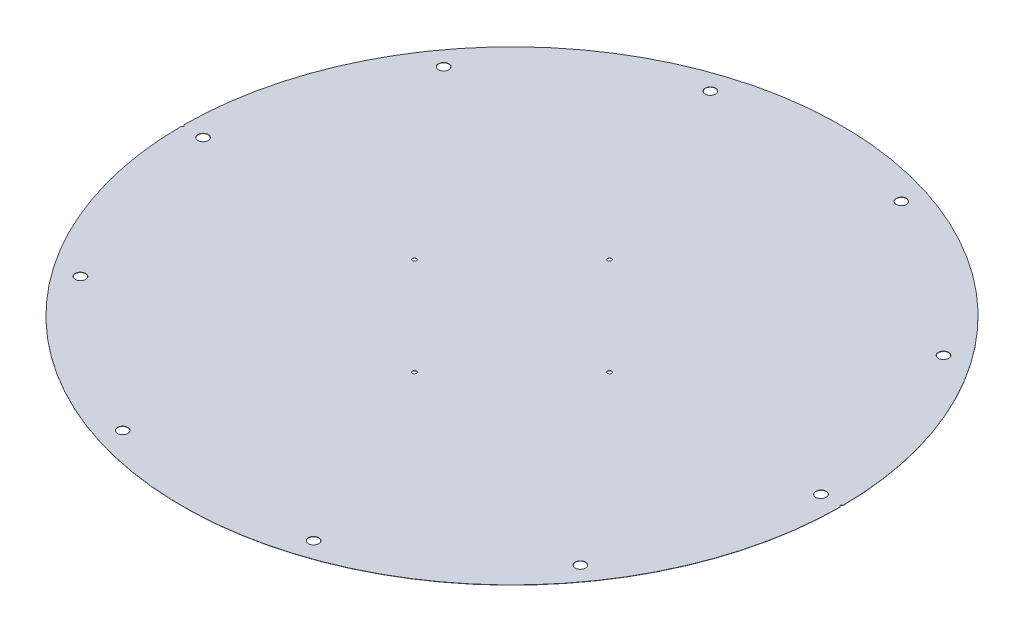
ISO-10303-21;
HEADER;
FILE_DESCRIPTION(('STEP AP214'),'2;1');
FILE_NAME('part.step','',(''),(''),'','','');
FILE_SCHEMA(('AUTOMOTIVE_DESIGN { 1 0 10303 214 1 1 1 1 }'));
ENDSEC;
DATA;
#1=APPLICATION_CONTEXT('core data for automotive mechanical design processes');
#2=APPLICATION_PROTOCOL_DEFINITION('international standard','automotive_design',2000,#1);
#3=PRODUCT_CONTEXT('',#1,'mechanical');
#4=PRODUCT('Part','Part','',(#3));
#5=PRODUCT_RELATED_PRODUCT_CATEGORY('part','',(#4));
#6=PRODUCT_DEFINITION_FORMATION('','',#4);
#7=PRODUCT_DEFINITION_CONTEXT('part definition',#1,'design');
#8=PRODUCT_DEFINITION('design','',#6,#7);
#9=PRODUCT_DEFINITION_SHAPE('','',#8);
#10=(LENGTH_UNIT() NAMED_UNIT(*) SI_UNIT(.MILLI.,.METRE.));
#11=(NAMED_UNIT(*) PLANE_ANGLE_UNIT() SI_UNIT($,.RADIAN.));
#12=(NAMED_UNIT(*) SI_UNIT($,.STERADIAN.) SOLID_ANGLE_UNIT());
#13=UNCERTAINTY_MEASURE_WITH_UNIT(LENGTH_MEASURE(1.E-05),#10,'distance_accuracy_value','');
#14=(GEOMETRIC_REPRESENTATION_CONTEXT(3) GLOBAL_UNCERTAINTY_ASSIGNED_CONTEXT((#13)) GLOBAL_UNIT_ASSIGNED_CONTEXT((#10,
#11,#12)) REPRESENTATION_CONTEXT('',''));
#15=CARTESIAN_POINT('',(0.,0.,0.));
#16=DIRECTION('',(0.,0.,1.));
#17=DIRECTION('',(1.,0.,0.));
#18=AXIS2_PLACEMENT_3D('',#15,#16,#17);
#19=CARTESIAN_POINT('',(0.,6.35,0.));
#20=DIRECTION('',(0.,-1.,0.));
#21=DIRECTION('',(0.,0.,-1.));
#22=AXIS2_PLACEMENT_3D('',#19,#20,#21);
#23=CYLINDRICAL_SURFACE('',#22,406.4);
#24=DIRECTION('',(0.,1.,0.));
#25=VECTOR('',#24,1.);
#26=CARTESIAN_POINT('',(406.396899414062,3.175,-1.58749697208118));
#27=LINE('',#26,#25);
#28=CARTESIAN_POINT('',(406.396899414062,6.35,-1.58749697208118));
#29=VERTEX_POINT('',#28);
#30=CARTESIAN_POINT('',(406.396899414062,6.096,-1.58749697208132));
#31=VERTEX_POINT('',#30);
#32=EDGE_CURVE('E47',#29,#31,#27,.F.);
#33=ORIENTED_EDGE('',*,*,#32,.T.);
#34=CARTESIAN_POINT('',(0.,6.096,0.));
#35=DIRECTION('',(0.,1.,0.));
#36=DIRECTION('',(0.,0.,1.));
#37=AXIS2_PLACEMENT_3D('',#34,#35,#36);
#38=CIRCLE('',#37,406.4);
#39=CARTESIAN_POINT('',(-406.396899414062,6.096,-1.58749697208395));
#40=VERTEX_POINT('',#39);
#41=EDGE_CURVE('E81',#31,#40,#38,.T.);
#42=ORIENTED_EDGE('',*,*,#41,.T.);
#43=DIRECTION('',(0.,1.,0.));
#44=VECTOR('',#43,1.);
#45=CARTESIAN_POINT('',(-406.396899414062,3.175,-1.58749697208118));
#46=LINE('',#45,#44);
#47=CARTESIAN_POINT('',(-406.396899414062,6.35,-1.58749697208118));
#48=VERTEX_POINT('',#47);
#49=EDGE_CURVE('E97',#40,#48,#46,.T.);
#50=ORIENTED_EDGE('',*,*,#49,.T.);
#51=CARTESIAN_POINT('',(0.,6.35,0.));
#52=DIRECTION('',(0.,1.,0.));
#53=DIRECTION('',(0.,0.,1.));
#54=AXIS2_PLACEMENT_3D('',#51,#52,#53);
#55=CIRCLE('',#54,406.4);
#56=EDGE_CURVE('E114',#29,#48,#55,.T.);
#57=ORIENTED_EDGE('',*,*,#56,.F.);
#58=EDGE_LOOP('',(#33,#42,#50,#57));
#59=FACE_BOUND('',#58,.T.);
#60=ADVANCED_FACE('F39',(#59),#23,.T.);
#61=DIRECTION('',(0.,1.,0.));
#62=VECTOR('',#61,1.);
#63=CARTESIAN_POINT('',(-406.396899414062,3.175,1.58749697208118));
#64=LINE('',#63,#62);
#65=CARTESIAN_POINT('',(-406.396899414062,6.35,1.58749697208118));
#66=VERTEX_POINT('',#65);
#67=CARTESIAN_POINT('',(-406.396899414062,6.096,1.58749697208118));
#68=VERTEX_POINT('',#67);
#69=EDGE_CURVE('E86',#66,#68,#64,.F.);
#70=ORIENTED_EDGE('',*,*,#69,.T.);
#71=CARTESIAN_POINT('',(0.,6.096,0.));
#72=DIRECTION('',(0.,1.,0.));
#73=DIRECTION('',(0.,0.,1.));
#74=AXIS2_PLACEMENT_3D('',#71,#72,#73);
#75=CIRCLE('',#74,406.4);
#76=CARTESIAN_POINT('',(406.396899414062,6.096,1.58749697208138));
#77=VERTEX_POINT('',#76);
#78=EDGE_CURVE('E54',#68,#77,#75,.T.);
#79=ORIENTED_EDGE('',*,*,#78,.T.);
#80=DIRECTION('',(0.,1.,0.));
#81=VECTOR('',#80,1.);
#82=CARTESIAN_POINT('',(406.396899414062,3.175,1.58749697208118));
#83=LINE('',#82,#81);
#84=CARTESIAN_POINT('',(406.396899414062,6.35,1.58749697208118));
#85=VERTEX_POINT('',#84);
#86=EDGE_CURVE('E12',#77,#85,#83,.T.);
#87=ORIENTED_EDGE('',*,*,#86,.T.);
#88=EDGE_CURVE('E117',#66,#85,#55,.T.);
#89=ORIENTED_EDGE('',*,*,#88,.F.);
#90=EDGE_LOOP('',(#70,#79,#87,#89));
#91=FACE_BOUND('',#90,.T.);
#92=ADVANCED_FACE('F41',(#91),#23,.T.);
#93=CARTESIAN_POINT('',(0.,6.35,0.));
#94=DIRECTION('',(0.,1.,0.));
#95=DIRECTION('',(0.,0.,1.));
#96=AXIS2_PLACEMENT_3D('',#93,#94,#95);
#97=PLANE('',#96);
#98=CARTESIAN_POINT('',(-406.4,6.35,0.));
#99=DIRECTION('',(0.,1.,0.));
#100=DIRECTION('',(0.,0.,1.));
#101=AXIS2_PLACEMENT_3D('',#98,#99,#100);
#102=CIRCLE('',#101,1.58750000000002);
#103=EDGE_CURVE('E128',#66,#48,#102,.T.);
#104=ORIENTED_EDGE('',*,*,#103,.F.);
#105=ORIENTED_EDGE('',*,*,#88,.T.);
#106=CARTESIAN_POINT('',(406.4,6.35,0.));
#107=DIRECTION('',(0.,1.,0.));
#108=DIRECTION('',(0.,0.,1.));
#109=AXIS2_PLACEMENT_3D('',#106,#107,#108);
#110=CIRCLE('',#109,1.58750000000002);
#111=EDGE_CURVE('E92',#29,#85,#110,.T.);
#112=ORIENTED_EDGE('',*,*,#111,.F.);
#113=ORIENTED_EDGE('',*,*,#56,.T.);
#114=EDGE_LOOP('',(#104,#105,#112,#113));
#115=FACE_BOUND('',#114,.T.);
#116=CARTESIAN_POINT('',(6.4920291364956E-11,6.35,120.256299999965));
#117=DIRECTION('',(0.,1.,0.));
#118=DIRECTION('',(0.,0.,1.));
#119=AXIS2_PLACEMENT_3D('',#116,#117,#118);
#120=CIRCLE('',#119,2.45745);
#121=CARTESIAN_POINT('',(6.4920291364956E-11,6.35,122.713749999965));
#122=VERTEX_POINT('',#121);
#123=EDGE_CURVE('E96',#122,#122,#120,.T.);
#124=ORIENTED_EDGE('',*,*,#123,.F.);
#125=EDGE_LOOP('',(#124));
#126=FACE_BOUND('',#125,.T.);
#127=CARTESIAN_POINT('',(120.256300000029,6.35,4.19872627328201E-13));
#128=DIRECTION('',(0.,1.,0.));
#129=DIRECTION('',(0.,0.,1.));
#130=AXIS2_PLACEMENT_3D('',#127,#128,#129);
#131=CIRCLE('',#130,2.45745);
#132=CARTESIAN_POINT('',(120.256300000029,6.35,2.45745000000042));
#133=VERTEX_POINT('',#132);
#134=EDGE_CURVE('E100',#133,#133,#131,.T.);
#135=ORIENTED_EDGE('',*,*,#134,.F.);
#136=EDGE_LOOP('',(#135));
#137=FACE_BOUND('',#136,.T.);
#138=CARTESIAN_POINT('',(6.49064135771482E-11,6.35,-120.256299999965));
#139=DIRECTION('',(0.,1.,0.));
#140=DIRECTION('',(0.,0.,1.));
#141=AXIS2_PLACEMENT_3D('',#138,#139,#140);
#142=CIRCLE('',#141,2.45745);
#143=CARTESIAN_POINT('',(6.49064135771482E-11,6.35,-117.798849999965));
#144=VERTEX_POINT('',#143);
#145=EDGE_CURVE('E237',#144,#144,#142,.T.);
#146=ORIENTED_EDGE('',*,*,#145,.F.);
#147=EDGE_LOOP('',(#146));
#148=FACE_BOUND('',#147,.T.);
#149=CARTESIAN_POINT('',(-120.2562999999,6.35,0.));
#150=DIRECTION('',(0.,1.,0.));
#151=DIRECTION('',(0.,0.,1.));
#152=AXIS2_PLACEMENT_3D('',#149,#150,#151);
#153=CIRCLE('',#152,2.45745);
#154=CARTESIAN_POINT('',(-120.2562999999,6.35,2.45745000000001));
#155=VERTEX_POINT('',#154);
#156=EDGE_CURVE('E232',#155,#155,#153,.T.);
#157=ORIENTED_EDGE('',*,*,#156,.F.);
#158=EDGE_LOOP('',(#157));
#159=FACE_BOUND('',#158,.T.);
#160=CARTESIAN_POINT('',(117.735474856858,6.35,-362.352532708474));
#161=DIRECTION('',(0.,1.,0.));
#162=DIRECTION('',(0.,0.,1.));
#163=AXIS2_PLACEMENT_3D('',#160,#161,#162);
#164=CIRCLE('',#163,6.4389);
#165=CARTESIAN_POINT('',(117.735474856858,6.35,-355.913632708474));
#166=VERTEX_POINT('',#165);
#167=EDGE_CURVE('E228',#166,#166,#164,.T.);
#168=ORIENTED_EDGE('',*,*,#167,.F.);
#169=EDGE_LOOP('',(#168));
#170=FACE_BOUND('',#169,.T.);
#171=CARTESIAN_POINT('',(308.235474856882,6.35,-223.946181123485));
#172=DIRECTION('',(0.,1.,0.));
#173=DIRECTION('',(0.,0.,1.));
#174=AXIS2_PLACEMENT_3D('',#171,#172,#173);
#175=CIRCLE('',#174,6.43890000000003);
#176=CARTESIAN_POINT('',(308.235474856882,6.35,-217.507281123485));
#177=VERTEX_POINT('',#176);
#178=EDGE_CURVE('E224',#177,#177,#175,.T.);
#179=ORIENTED_EDGE('',*,*,#178,.F.);
#180=EDGE_LOOP('',(#179));
#181=FACE_BOUND('',#180,.T.);
#182=CARTESIAN_POINT('',(381.000000000065,6.35,-6.4925368714856E-11));
#183=DIRECTION('',(0.,1.,0.));
#184=DIRECTION('',(0.,0.,1.));
#185=AXIS2_PLACEMENT_3D('',#182,#183,#184);
#186=CIRCLE('',#185,6.43890000000003);
#187=CARTESIAN_POINT('',(381.000000000065,6.35,6.4388999999351));
#188=VERTEX_POINT('',#187);
#189=EDGE_CURVE('E221',#188,#188,#186,.T.);
#190=ORIENTED_EDGE('',*,*,#189,.F.);
#191=EDGE_LOOP('',(#190));
#192=FACE_BOUND('',#191,.T.);
#193=CARTESIAN_POINT('',(308.235474856958,6.35,223.94618112338));
#194=DIRECTION('',(0.,1.,0.));
#195=DIRECTION('',(0.,0.,1.));
#196=AXIS2_PLACEMENT_3D('',#193,#194,#195);
#197=CIRCLE('',#196,6.43890000000003);
#198=CARTESIAN_POINT('',(308.235474856958,6.35,230.38508112338));
#199=VERTEX_POINT('',#198);
#200=EDGE_CURVE('E213',#199,#199,#197,.T.);
#201=ORIENTED_EDGE('',*,*,#200,.F.);
#202=EDGE_LOOP('',(#201));
#203=FACE_BOUND('',#202,.T.);
#204=CARTESIAN_POINT('',(117.735474856982,6.35,362.352532708395));
#205=DIRECTION('',(0.,1.,0.));
#206=DIRECTION('',(0.,0.,1.));
#207=AXIS2_PLACEMENT_3D('',#204,#205,#206);
#208=CIRCLE('',#207,6.4389);
#209=CARTESIAN_POINT('',(117.735474856982,6.35,368.791432708395));
#210=VERTEX_POINT('',#209);
#211=EDGE_CURVE('E209',#210,#210,#208,.T.);
#212=ORIENTED_EDGE('',*,*,#211,.F.);
#213=EDGE_LOOP('',(#212));
#214=FACE_BOUND('',#213,.T.);
#215=CARTESIAN_POINT('',(-117.735474856728,6.35,362.352532708474));
#216=DIRECTION('',(0.,1.,0.));
#217=DIRECTION('',(0.,0.,1.));
#218=AXIS2_PLACEMENT_3D('',#215,#216,#217);
#219=CIRCLE('',#218,6.4389);
#220=CARTESIAN_POINT('',(-117.735474856728,6.35,368.791432708474));
#221=VERTEX_POINT('',#220);
#222=EDGE_CURVE('E205',#221,#221,#219,.T.);
#223=ORIENTED_EDGE('',*,*,#222,.F.);
#224=EDGE_LOOP('',(#223));
#225=FACE_BOUND('',#224,.T.);
#226=CARTESIAN_POINT('',(-308.235474856752,6.35,223.946181123485));
#227=DIRECTION('',(0.,1.,0.));
#228=DIRECTION('',(0.,0.,1.));
#229=AXIS2_PLACEMENT_3D('',#226,#227,#228);
#230=CIRCLE('',#229,6.43890000000003);
#231=CARTESIAN_POINT('',(-308.235474856752,6.35,230.385081123485));
#232=VERTEX_POINT('',#231);
#233=EDGE_CURVE('E141',#232,#232,#230,.T.);
#234=ORIENTED_EDGE('',*,*,#233,.F.);
#235=EDGE_LOOP('',(#234));
#236=FACE_BOUND('',#235,.T.);
#237=CARTESIAN_POINT('',(-380.999999999935,6.35,6.49720277579036E-11));
#238=DIRECTION('',(0.,1.,0.));
#239=DIRECTION('',(0.,0.,1.));
#240=AXIS2_PLACEMENT_3D('',#237,#238,#239);
#241=CIRCLE('',#240,6.43890000000003);
#242=CARTESIAN_POINT('',(-380.999999999935,6.35,6.438900000065));
#243=VERTEX_POINT('',#242);
#244=EDGE_CURVE('E137',#243,#243,#241,.T.);
#245=ORIENTED_EDGE('',*,*,#244,.F.);
#246=EDGE_LOOP('',(#245));
#247=FACE_BOUND('',#246,.T.);
#248=CARTESIAN_POINT('',(-308.235474856828,6.35,-223.94618112338));
#249=DIRECTION('',(0.,1.,0.));
#250=DIRECTION('',(0.,0.,1.));
#251=AXIS2_PLACEMENT_3D('',#248,#249,#250);
#252=CIRCLE('',#251,6.43890000000003);
#253=CARTESIAN_POINT('',(-308.235474856828,6.35,-217.50728112338));
#254=VERTEX_POINT('',#253);
#255=EDGE_CURVE('E133',#254,#254,#252,.T.);
#256=ORIENTED_EDGE('',*,*,#255,.F.);
#257=EDGE_LOOP('',(#256));
#258=FACE_BOUND('',#257,.T.);
#259=CARTESIAN_POINT('',(-117.735474856852,6.35,-362.352532708434));
#260=DIRECTION('',(0.,1.,0.));
#261=DIRECTION('',(0.,0.,1.));
#262=AXIS2_PLACEMENT_3D('',#259,#260,#261);
#263=CIRCLE('',#262,6.4389);
#264=CARTESIAN_POINT('',(-117.735474856852,6.35,-355.913632708433));
#265=VERTEX_POINT('',#264);
#266=EDGE_CURVE('E118',#265,#265,#263,.T.);
#267=ORIENTED_EDGE('',*,*,#266,.F.);
#268=EDGE_LOOP('',(#267));
#269=FACE_BOUND('',#268,.T.);
#270=ADVANCED_FACE('F126',(#115,#126,#137,#148,#159,#170,#181,#192,#203,#214,#225,#236,#247,
#258,#269),#97,.T.);
#271=CARTESIAN_POINT('',(-117.735474856852,6.35,-362.352532708434));
#272=DIRECTION('',(0.,1.,0.));
#273=DIRECTION('',(0.,0.,1.));
#274=AXIS2_PLACEMENT_3D('',#271,#272,#273);
#275=CONICAL_SURFACE('',#274,6.4389,0.715584993317675);
#276=CARTESIAN_POINT('',(-117.735474856852,6.096,-362.352532708434));
#277=DIRECTION('',(0.,1.,0.));
#278=DIRECTION('',(0.,0.,1.));
#279=AXIS2_PLACEMENT_3D('',#276,#277,#278);
#280=CIRCLE('',#279,6.21810116859467);
#281=CARTESIAN_POINT('',(-117.735474856852,6.096,-356.134431539839));
#282=VERTEX_POINT('',#281);
#283=EDGE_CURVE('E130',#282,#282,#280,.F.);
#284=ORIENTED_EDGE('',*,*,#283,.T.);
#285=EDGE_LOOP('',(#284));
#286=FACE_BOUND('',#285,.T.);
#287=ORIENTED_EDGE('',*,*,#266,.T.);
#288=EDGE_LOOP('',(#287));
#289=FACE_BOUND('',#288,.T.);
#290=ADVANCED_FACE('F248',(#286,#289),#275,.F.);
#291=CARTESIAN_POINT('',(-308.235474856828,6.35,-223.94618112338));
#292=DIRECTION('',(0.,1.,0.));
#293=DIRECTION('',(0.,0.,1.));
#294=AXIS2_PLACEMENT_3D('',#291,#292,#293);
#295=CONICAL_SURFACE('',#294,6.43890000000003,0.715584993317679);
#296=CARTESIAN_POINT('',(-308.235474856828,6.096,-223.94618112338));
#297=DIRECTION('',(0.,1.,0.));
#298=DIRECTION('',(0.,0.,1.));
#299=AXIS2_PLACEMENT_3D('',#296,#297,#298);
#300=CIRCLE('',#299,6.2181011685947);
#301=CARTESIAN_POINT('',(-308.235474856828,6.096,-217.728079954785));
#302=VERTEX_POINT('',#301);
#303=EDGE_CURVE('E457',#302,#302,#300,.F.);
#304=ORIENTED_EDGE('',*,*,#303,.T.);
#305=EDGE_LOOP('',(#304));
#306=FACE_BOUND('',#305,.T.);
#307=ORIENTED_EDGE('',*,*,#255,.T.);
#308=EDGE_LOOP('',(#307));
#309=FACE_BOUND('',#308,.T.);
#310=ADVANCED_FACE('F276',(#306,#309),#295,.F.);
#311=CARTESIAN_POINT('',(-380.999999999935,6.35,6.49720277579036E-11));
#312=DIRECTION('',(0.,1.,0.));
#313=DIRECTION('',(0.,0.,1.));
#314=AXIS2_PLACEMENT_3D('',#311,#312,#313);
#315=CONICAL_SURFACE('',#314,6.43890000000003,0.715584993317679);
#316=CARTESIAN_POINT('',(-380.999999999935,6.096,6.49720277579036E-11));
#317=DIRECTION('',(0.,1.,0.));
#318=DIRECTION('',(0.,0.,1.));
#319=AXIS2_PLACEMENT_3D('',#316,#317,#318);
#320=CIRCLE('',#319,6.2181011685947);
#321=CARTESIAN_POINT('',(-380.999999999935,6.096,6.21810116865967));
#322=VERTEX_POINT('',#321);
#323=EDGE_CURVE('E504',#322,#322,#320,.F.);
#324=ORIENTED_EDGE('',*,*,#323,.T.);
#325=EDGE_LOOP('',(#324));
#326=FACE_BOUND('',#325,.T.);
#327=ORIENTED_EDGE('',*,*,#244,.T.);
#328=EDGE_LOOP('',(#327));
#329=FACE_BOUND('',#328,.T.);
#330=ADVANCED_FACE('F273',(#326,#329),#315,.F.);
#331=CARTESIAN_POINT('',(-308.235474856752,6.35,223.946181123485));
#332=DIRECTION('',(0.,1.,0.));
#333=DIRECTION('',(0.,0.,1.));
#334=AXIS2_PLACEMENT_3D('',#331,#332,#333);
#335=CONICAL_SURFACE('',#334,6.43890000000003,0.715584993317679);
#336=CARTESIAN_POINT('',(-308.235474856752,6.096,223.946181123485));
#337=DIRECTION('',(0.,1.,0.));
#338=DIRECTION('',(0.,0.,1.));
#339=AXIS2_PLACEMENT_3D('',#336,#337,#338);
#340=CIRCLE('',#339,6.2181011685947);
#341=CARTESIAN_POINT('',(-308.235474856752,6.096,230.16428229208));
#342=VERTEX_POINT('',#341);
#343=EDGE_CURVE('E461',#342,#342,#340,.F.);
#344=ORIENTED_EDGE('',*,*,#343,.T.);
#345=EDGE_LOOP('',(#344));
#346=FACE_BOUND('',#345,.T.);
#347=ORIENTED_EDGE('',*,*,#233,.T.);
#348=EDGE_LOOP('',(#347));
#349=FACE_BOUND('',#348,.T.);
#350=ADVANCED_FACE('F275',(#346,#349),#335,.F.);
#351=CARTESIAN_POINT('',(-117.735474856728,6.35,362.352532708474));
#352=DIRECTION('',(0.,1.,0.));
#353=DIRECTION('',(0.,0.,1.));
#354=AXIS2_PLACEMENT_3D('',#351,#352,#353);
#355=CONICAL_SURFACE('',#354,6.4389,0.715584993317675);
#356=CARTESIAN_POINT('',(-117.735474856728,6.096,362.352532708474));
#357=DIRECTION('',(0.,1.,0.));
#358=DIRECTION('',(0.,0.,1.));
#359=AXIS2_PLACEMENT_3D('',#356,#357,#358);
#360=CIRCLE('',#359,6.21810116859467);
#361=CARTESIAN_POINT('',(-117.735474856728,6.096,368.570633877068));
#362=VERTEX_POINT('',#361);
#363=EDGE_CURVE('E500',#362,#362,#360,.F.);
#364=ORIENTED_EDGE('',*,*,#363,.T.);
#365=EDGE_LOOP('',(#364));
#366=FACE_BOUND('',#365,.T.);
#367=ORIENTED_EDGE('',*,*,#222,.T.);
#368=EDGE_LOOP('',(#367));
#369=FACE_BOUND('',#368,.T.);
#370=ADVANCED_FACE('F283',(#366,#369),#355,.F.);
#371=CARTESIAN_POINT('',(117.735474856982,6.35,362.352532708395));
#372=DIRECTION('',(0.,1.,0.));
#373=DIRECTION('',(0.,0.,1.));
#374=AXIS2_PLACEMENT_3D('',#371,#372,#373);
#375=CONICAL_SURFACE('',#374,6.4389,0.715584993317675);
#376=CARTESIAN_POINT('',(117.735474856982,6.096,362.352532708395));
#377=DIRECTION('',(0.,1.,0.));
#378=DIRECTION('',(0.,0.,1.));
#379=AXIS2_PLACEMENT_3D('',#376,#377,#378);
#380=CIRCLE('',#379,6.21810116859467);
#381=CARTESIAN_POINT('',(117.735474856982,6.096,368.57063387699));
#382=VERTEX_POINT('',#381);
#383=EDGE_CURVE('E465',#382,#382,#380,.F.);
#384=ORIENTED_EDGE('',*,*,#383,.T.);
#385=EDGE_LOOP('',(#384));
#386=FACE_BOUND('',#385,.T.);
#387=ORIENTED_EDGE('',*,*,#211,.T.);
#388=EDGE_LOOP('',(#387));
#389=FACE_BOUND('',#388,.T.);
#390=ADVANCED_FACE('F330',(#386,#389),#375,.F.);
#391=CARTESIAN_POINT('',(308.235474856958,6.35,223.94618112338));
#392=DIRECTION('',(0.,1.,0.));
#393=DIRECTION('',(0.,0.,1.));
#394=AXIS2_PLACEMENT_3D('',#391,#392,#393);
#395=CONICAL_SURFACE('',#394,6.43890000000003,0.715584993317679);
#396=CARTESIAN_POINT('',(308.235474856958,6.096,223.94618112338));
#397=DIRECTION('',(0.,1.,0.));
#398=DIRECTION('',(0.,0.,1.));
#399=AXIS2_PLACEMENT_3D('',#396,#397,#398);
#400=CIRCLE('',#399,6.2181011685947);
#401=CARTESIAN_POINT('',(308.235474856958,6.096,230.164282291974));
#402=VERTEX_POINT('',#401);
#403=EDGE_CURVE('E496',#402,#402,#400,.F.);
#404=ORIENTED_EDGE('',*,*,#403,.T.);
#405=EDGE_LOOP('',(#404));
#406=FACE_BOUND('',#405,.T.);
#407=ORIENTED_EDGE('',*,*,#200,.T.);
#408=EDGE_LOOP('',(#407));
#409=FACE_BOUND('',#408,.T.);
#410=ADVANCED_FACE('F340',(#406,#409),#395,.F.);
#411=CARTESIAN_POINT('',(381.000000000065,6.35,-6.4925368714856E-11));
#412=DIRECTION('',(0.,1.,0.));
#413=DIRECTION('',(0.,0.,1.));
#414=AXIS2_PLACEMENT_3D('',#411,#412,#413);
#415=CONICAL_SURFACE('',#414,6.43890000000003,0.715584993317679);
#416=CARTESIAN_POINT('',(381.000000000065,6.096,-6.4925368714856E-11));
#417=DIRECTION('',(0.,1.,0.));
#418=DIRECTION('',(0.,0.,1.));
#419=AXIS2_PLACEMENT_3D('',#416,#417,#418);
#420=CIRCLE('',#419,6.2181011685947);
#421=CARTESIAN_POINT('',(381.000000000065,6.096,6.21810116852977));
#422=VERTEX_POINT('',#421);
#423=EDGE_CURVE('E469',#422,#422,#420,.F.);
#424=ORIENTED_EDGE('',*,*,#423,.T.);
#425=EDGE_LOOP('',(#424));
#426=FACE_BOUND('',#425,.T.);
#427=ORIENTED_EDGE('',*,*,#189,.T.);
#428=EDGE_LOOP('',(#427));
#429=FACE_BOUND('',#428,.T.);
#430=ADVANCED_FACE('F350',(#426,#429),#415,.F.);
#431=CARTESIAN_POINT('',(308.235474856882,6.35,-223.946181123485));
#432=DIRECTION('',(0.,1.,0.));
#433=DIRECTION('',(0.,0.,1.));
#434=AXIS2_PLACEMENT_3D('',#431,#432,#433);
#435=CONICAL_SURFACE('',#434,6.43890000000003,0.715584993317679);
#436=CARTESIAN_POINT('',(308.235474856882,6.096,-223.946181123485));
#437=DIRECTION('',(0.,1.,0.));
#438=DIRECTION('',(0.,0.,1.));
#439=AXIS2_PLACEMENT_3D('',#436,#437,#438);
#440=CIRCLE('',#439,6.2181011685947);
#441=CARTESIAN_POINT('',(308.235474856882,6.096,-217.72807995489));
#442=VERTEX_POINT('',#441);
#443=EDGE_CURVE('E492',#442,#442,#440,.F.);
#444=ORIENTED_EDGE('',*,*,#443,.T.);
#445=EDGE_LOOP('',(#444));
#446=FACE_BOUND('',#445,.T.);
#447=ORIENTED_EDGE('',*,*,#178,.T.);
#448=EDGE_LOOP('',(#447));
#449=FACE_BOUND('',#448,.T.);
#450=ADVANCED_FACE('F360',(#446,#449),#435,.F.);
#451=CARTESIAN_POINT('',(117.735474856858,6.35,-362.352532708474));
#452=DIRECTION('',(0.,1.,0.));
#453=DIRECTION('',(0.,0.,1.));
#454=AXIS2_PLACEMENT_3D('',#451,#452,#453);
#455=CONICAL_SURFACE('',#454,6.4389,0.715584993317675);
#456=CARTESIAN_POINT('',(117.735474856858,6.096,-362.352532708474));
#457=DIRECTION('',(0.,1.,0.));
#458=DIRECTION('',(0.,0.,1.));
#459=AXIS2_PLACEMENT_3D('',#456,#457,#458);
#460=CIRCLE('',#459,6.21810116859467);
#461=CARTESIAN_POINT('',(117.735474856858,6.096,-356.134431539879));
#462=VERTEX_POINT('',#461);
#463=EDGE_CURVE('E473',#462,#462,#460,.F.);
#464=ORIENTED_EDGE('',*,*,#463,.T.);
#465=EDGE_LOOP('',(#464));
#466=FACE_BOUND('',#465,.T.);
#467=ORIENTED_EDGE('',*,*,#167,.T.);
#468=EDGE_LOOP('',(#467));
#469=FACE_BOUND('',#468,.T.);
#470=ADVANCED_FACE('F370',(#466,#469),#455,.F.);
#471=CARTESIAN_POINT('',(-120.2562999999,6.35,0.));
#472=DIRECTION('',(0.,1.,0.));
#473=DIRECTION('',(0.,0.,1.));
#474=AXIS2_PLACEMENT_3D('',#471,#472,#473);
#475=CYLINDRICAL_SURFACE('',#474,2.45745);
#476=CARTESIAN_POINT('',(-120.2562999999,6.096,0.));
#477=DIRECTION('',(0.,1.,0.));
#478=DIRECTION('',(0.,0.,1.));
#479=AXIS2_PLACEMENT_3D('',#476,#477,#478);
#480=CIRCLE('',#479,2.45745);
#481=CARTESIAN_POINT('',(-120.2562999999,6.096,2.45745000000001));
#482=VERTEX_POINT('',#481);
#483=EDGE_CURVE('E488',#482,#482,#480,.F.);
#484=ORIENTED_EDGE('',*,*,#483,.T.);
#485=EDGE_LOOP('',(#484));
#486=FACE_BOUND('',#485,.T.);
#487=ORIENTED_EDGE('',*,*,#156,.T.);
#488=EDGE_LOOP('',(#487));
#489=FACE_BOUND('',#488,.T.);
#490=ADVANCED_FACE('F380',(#486,#489),#475,.F.);
#491=CARTESIAN_POINT('',(6.49064135771482E-11,6.35,-120.256299999965));
#492=DIRECTION('',(0.,1.,0.));
#493=DIRECTION('',(0.,0.,1.));
#494=AXIS2_PLACEMENT_3D('',#491,#492,#493);
#495=CYLINDRICAL_SURFACE('',#494,2.45745);
#496=CARTESIAN_POINT('',(6.49064135771482E-11,6.096,-120.256299999965));
#497=DIRECTION('',(0.,1.,0.));
#498=DIRECTION('',(0.,0.,1.));
#499=AXIS2_PLACEMENT_3D('',#496,#497,#498);
#500=CIRCLE('',#499,2.45745);
#501=CARTESIAN_POINT('',(6.49064135771482E-11,6.096,-117.798849999965));
#502=VERTEX_POINT('',#501);
#503=EDGE_CURVE('E477',#502,#502,#500,.F.);
#504=ORIENTED_EDGE('',*,*,#503,.T.);
#505=EDGE_LOOP('',(#504));
#506=FACE_BOUND('',#505,.T.);
#507=ORIENTED_EDGE('',*,*,#145,.T.);
#508=EDGE_LOOP('',(#507));
#509=FACE_BOUND('',#508,.T.);
#510=ADVANCED_FACE('F390',(#506,#509),#495,.F.);
#511=CARTESIAN_POINT('',(120.256300000029,6.35,4.19872627328201E-13));
#512=DIRECTION('',(0.,1.,0.));
#513=DIRECTION('',(0.,0.,1.));
#514=AXIS2_PLACEMENT_3D('',#511,#512,#513);
#515=CYLINDRICAL_SURFACE('',#514,2.45745);
#516=CARTESIAN_POINT('',(120.256300000029,6.096,4.19872627328201E-13));
#517=DIRECTION('',(0.,1.,0.));
#518=DIRECTION('',(0.,0.,1.));
#519=AXIS2_PLACEMENT_3D('',#516,#517,#518);
#520=CIRCLE('',#519,2.45745);
#521=CARTESIAN_POINT('',(120.256300000029,6.096,2.45745000000042));
#522=VERTEX_POINT('',#521);
#523=EDGE_CURVE('E481',#522,#522,#520,.F.);
#524=ORIENTED_EDGE('',*,*,#523,.T.);
#525=EDGE_LOOP('',(#524));
#526=FACE_BOUND('',#525,.T.);
#527=ORIENTED_EDGE('',*,*,#134,.T.);
#528=EDGE_LOOP('',(#527));
#529=FACE_BOUND('',#528,.T.);
#530=ADVANCED_FACE('F244',(#526,#529),#515,.F.);
#531=CARTESIAN_POINT('',(6.4920291364956E-11,6.35,120.256299999965));
#532=DIRECTION('',(0.,1.,0.));
#533=DIRECTION('',(0.,0.,1.));
#534=AXIS2_PLACEMENT_3D('',#531,#532,#533);
#535=CYLINDRICAL_SURFACE('',#534,2.45745);
#536=CARTESIAN_POINT('',(6.4920291364956E-11,6.096,120.256299999965));
#537=DIRECTION('',(0.,1.,0.));
#538=DIRECTION('',(0.,0.,1.));
#539=AXIS2_PLACEMENT_3D('',#536,#537,#538);
#540=CIRCLE('',#539,2.45745);
#541=CARTESIAN_POINT('',(6.4920291364956E-11,6.096,122.713749999965));
#542=VERTEX_POINT('',#541);
#543=EDGE_CURVE('E480',#542,#542,#540,.F.);
#544=ORIENTED_EDGE('',*,*,#543,.T.);
#545=EDGE_LOOP('',(#544));
#546=FACE_BOUND('',#545,.T.);
#547=ORIENTED_EDGE('',*,*,#123,.T.);
#548=EDGE_LOOP('',(#547));
#549=FACE_BOUND('',#548,.T.);
#550=ADVANCED_FACE('F409',(#546,#549),#535,.F.);
#551=CARTESIAN_POINT('',(406.4,6.35,0.));
#552=DIRECTION('',(0.,1.,0.));
#553=DIRECTION('',(0.,0.,1.));
#554=AXIS2_PLACEMENT_3D('',#551,#552,#553);
#555=CYLINDRICAL_SURFACE('',#554,1.58750000000002);
#556=ORIENTED_EDGE('',*,*,#86,.F.);
#557=CARTESIAN_POINT('',(406.4,6.096,0.));
#558=DIRECTION('',(0.,-1.,0.));
#559=DIRECTION('',(0.,0.,1.));
#560=AXIS2_PLACEMENT_3D('',#557,#558,#559);
#561=CIRCLE('',#560,1.58750000000016);
#562=EDGE_CURVE('E77',#77,#31,#561,.T.);
#563=ORIENTED_EDGE('',*,*,#562,.T.);
#564=ORIENTED_EDGE('',*,*,#32,.F.);
#565=ORIENTED_EDGE('',*,*,#111,.T.);
#566=EDGE_LOOP('',(#556,#563,#564,#565));
#567=FACE_BOUND('',#566,.T.);
#568=ADVANCED_FACE('F90',(#567),#555,.F.);
#569=CARTESIAN_POINT('',(-406.4,6.35,0.));
#570=DIRECTION('',(0.,1.,0.));
#571=DIRECTION('',(0.,0.,1.));
#572=AXIS2_PLACEMENT_3D('',#569,#570,#571);
#573=CYLINDRICAL_SURFACE('',#572,1.58750000000002);
#574=ORIENTED_EDGE('',*,*,#49,.F.);
#575=CARTESIAN_POINT('',(-406.4,6.096,0.));
#576=DIRECTION('',(0.,-1.,0.));
#577=DIRECTION('',(0.,0.,1.));
#578=AXIS2_PLACEMENT_3D('',#575,#576,#577);
#579=CIRCLE('',#578,1.58750000000137);
#580=EDGE_CURVE('E87',#40,#68,#579,.T.);
#581=ORIENTED_EDGE('',*,*,#580,.T.);
#582=ORIENTED_EDGE('',*,*,#69,.F.);
#583=ORIENTED_EDGE('',*,*,#103,.T.);
#584=EDGE_LOOP('',(#574,#581,#582,#583));
#585=FACE_BOUND('',#584,.T.);
#586=ADVANCED_FACE('F429',(#585),#573,.F.);
#587=CARTESIAN_POINT('',(-203.2,6.096,0.));
#588=DIRECTION('',(0.,1.,0.));
#589=DIRECTION('',(0.,0.,1.));
#590=AXIS2_PLACEMENT_3D('',#587,#588,#589);
#591=PLANE('',#590);
#592=ORIENTED_EDGE('',*,*,#303,.F.);
#593=EDGE_LOOP('',(#592));
#594=FACE_BOUND('',#593,.T.);
#595=ORIENTED_EDGE('',*,*,#343,.F.);
#596=EDGE_LOOP('',(#595));
#597=FACE_BOUND('',#596,.T.);
#598=ORIENTED_EDGE('',*,*,#383,.F.);
#599=EDGE_LOOP('',(#598));
#600=FACE_BOUND('',#599,.T.);
#601=ORIENTED_EDGE('',*,*,#423,.F.);
#602=EDGE_LOOP('',(#601));
#603=FACE_BOUND('',#602,.T.);
#604=ORIENTED_EDGE('',*,*,#463,.F.);
#605=EDGE_LOOP('',(#604));
#606=FACE_BOUND('',#605,.T.);
#607=ORIENTED_EDGE('',*,*,#503,.F.);
#608=EDGE_LOOP('',(#607));
#609=FACE_BOUND('',#608,.T.);
#610=ORIENTED_EDGE('',*,*,#543,.F.);
#611=EDGE_LOOP('',(#610));
#612=FACE_BOUND('',#611,.T.);
#613=ORIENTED_EDGE('',*,*,#580,.F.);
#614=ORIENTED_EDGE('',*,*,#41,.F.);
#615=ORIENTED_EDGE('',*,*,#562,.F.);
#616=ORIENTED_EDGE('',*,*,#78,.F.);
#617=EDGE_LOOP('',(#613,#614,#615,#616));
#618=FACE_BOUND('',#617,.T.);
#619=ORIENTED_EDGE('',*,*,#523,.F.);
#620=EDGE_LOOP('',(#619));
#621=FACE_BOUND('',#620,.T.);
#622=ORIENTED_EDGE('',*,*,#483,.F.);
#623=EDGE_LOOP('',(#622));
#624=FACE_BOUND('',#623,.T.);
#625=ORIENTED_EDGE('',*,*,#443,.F.);
#626=EDGE_LOOP('',(#625));
#627=FACE_BOUND('',#626,.T.);
#628=ORIENTED_EDGE('',*,*,#403,.F.);
#629=EDGE_LOOP('',(#628));
#630=FACE_BOUND('',#629,.T.);
#631=ORIENTED_EDGE('',*,*,#363,.F.);
#632=EDGE_LOOP('',(#631));
#633=FACE_BOUND('',#632,.T.);
#634=ORIENTED_EDGE('',*,*,#323,.F.);
#635=EDGE_LOOP('',(#634));
#636=FACE_BOUND('',#635,.T.);
#637=ORIENTED_EDGE('',*,*,#283,.F.);
#638=EDGE_LOOP('',(#637));
#639=FACE_BOUND('',#638,.T.);
#640=ADVANCED_FACE('F78',(#594,#597,#600,#603,#606,#609,#612,#618,#621,#624,#627,#630,#633,#636,
#639),#591,.F.);
#641=CLOSED_SHELL('',(#60,#92,#270,#290,#310,#330,#350,#370,#390,#410,#430,#450,#470,#490,#510,
#530,#550,#568,#586,#640));
#642=MANIFOLD_SOLID_BREP('B2',#641);
#643=ADVANCED_BREP_SHAPE_REPRESENTATION('',(#18,#642),#14);
#644=SHAPE_DEFINITION_REPRESENTATION(#9,#643);
ENDSEC;
END-ISO-10303-21;
